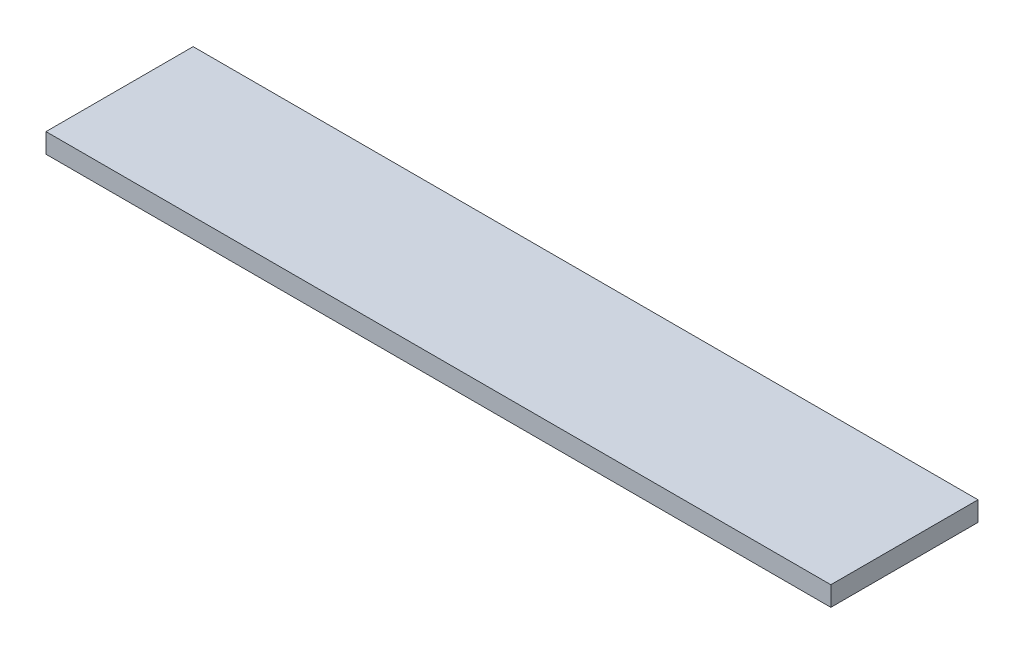
ISO-10303-21;
HEADER;
FILE_DESCRIPTION(('STEP AP214'),'2;1');
FILE_NAME('part.step','',(''),(''),'','','');
FILE_SCHEMA(('AUTOMOTIVE_DESIGN { 1 0 10303 214 1 1 1 1 }'));
ENDSEC;
DATA;
#1=APPLICATION_CONTEXT('core data for automotive mechanical design processes');
#2=APPLICATION_PROTOCOL_DEFINITION('international standard','automotive_design',2000,#1);
#3=PRODUCT_CONTEXT('',#1,'mechanical');
#4=PRODUCT('Part','Part','',(#3));
#5=PRODUCT_RELATED_PRODUCT_CATEGORY('part','',(#4));
#6=PRODUCT_DEFINITION_FORMATION('','',#4);
#7=PRODUCT_DEFINITION_CONTEXT('part definition',#1,'design');
#8=PRODUCT_DEFINITION('design','',#6,#7);
#9=PRODUCT_DEFINITION_SHAPE('','',#8);
#10=(LENGTH_UNIT() NAMED_UNIT(*) SI_UNIT(.MILLI.,.METRE.));
#11=(NAMED_UNIT(*) PLANE_ANGLE_UNIT() SI_UNIT($,.RADIAN.));
#12=(NAMED_UNIT(*) SI_UNIT($,.STERADIAN.) SOLID_ANGLE_UNIT());
#13=UNCERTAINTY_MEASURE_WITH_UNIT(LENGTH_MEASURE(1.E-05),#10,'distance_accuracy_value','');
#14=(GEOMETRIC_REPRESENTATION_CONTEXT(3) GLOBAL_UNCERTAINTY_ASSIGNED_CONTEXT((#13)) GLOBAL_UNIT_ASSIGNED_CONTEXT((#10,
#11,#12)) REPRESENTATION_CONTEXT('',''));
#15=CARTESIAN_POINT('',(0.,0.,0.));
#16=DIRECTION('',(0.,0.,1.));
#17=DIRECTION('',(1.,0.,0.));
#18=AXIS2_PLACEMENT_3D('',#15,#16,#17);
#19=CARTESIAN_POINT('',(400.,20.,-75.));
#20=DIRECTION('',(-1.,0.,0.));
#21=DIRECTION('',(0.,0.,1.));
#22=AXIS2_PLACEMENT_3D('',#19,#20,#21);
#23=PLANE('',#22);
#24=DIRECTION('',(0.,0.,-1.));
#25=VECTOR('',#24,1.);
#26=CARTESIAN_POINT('',(400.,0.,-75.));
#27=LINE('',#26,#25);
#28=CARTESIAN_POINT('',(400.,0.,75.));
#29=VERTEX_POINT('',#28);
#30=CARTESIAN_POINT('',(400.,0.,-75.));
#31=VERTEX_POINT('',#30);
#32=EDGE_CURVE('E100',#29,#31,#27,.T.);
#33=ORIENTED_EDGE('',*,*,#32,.T.);
#34=DIRECTION('',(0.,-1.,0.));
#35=VECTOR('',#34,1.);
#36=CARTESIAN_POINT('',(400.,20.,-75.));
#37=LINE('',#36,#35);
#38=CARTESIAN_POINT('',(400.,20.,-75.));
#39=VERTEX_POINT('',#38);
#40=EDGE_CURVE('E11',#39,#31,#37,.T.);
#41=ORIENTED_EDGE('',*,*,#40,.F.);
#42=DIRECTION('',(0.,0.,-1.));
#43=VECTOR('',#42,1.);
#44=CARTESIAN_POINT('',(400.,20.,-75.));
#45=LINE('',#44,#43);
#46=CARTESIAN_POINT('',(400.,20.,75.));
#47=VERTEX_POINT('',#46);
#48=EDGE_CURVE('E88',#47,#39,#45,.T.);
#49=ORIENTED_EDGE('',*,*,#48,.F.);
#50=DIRECTION('',(0.,-1.,0.));
#51=VECTOR('',#50,1.);
#52=CARTESIAN_POINT('',(400.,20.,75.));
#53=LINE('',#52,#51);
#54=EDGE_CURVE('E96',#47,#29,#53,.T.);
#55=ORIENTED_EDGE('',*,*,#54,.T.);
#56=EDGE_LOOP('',(#33,#41,#49,#55));
#57=FACE_BOUND('',#56,.T.);
#58=ADVANCED_FACE('F37',(#57),#23,.F.);
#59=CARTESIAN_POINT('',(-400.,20.,-75.));
#60=DIRECTION('',(0.,0.,1.));
#61=DIRECTION('',(1.,0.,0.));
#62=AXIS2_PLACEMENT_3D('',#59,#60,#61);
#63=PLANE('',#62);
#64=DIRECTION('',(-1.,0.,0.));
#65=VECTOR('',#64,1.);
#66=CARTESIAN_POINT('',(-400.,0.,-75.));
#67=LINE('',#66,#65);
#68=CARTESIAN_POINT('',(-400.,0.,-75.));
#69=VERTEX_POINT('',#68);
#70=EDGE_CURVE('E92',#31,#69,#67,.T.);
#71=ORIENTED_EDGE('',*,*,#70,.T.);
#72=DIRECTION('',(0.,-1.,0.));
#73=VECTOR('',#72,1.);
#74=CARTESIAN_POINT('',(-400.,20.,-75.));
#75=LINE('',#74,#73);
#76=CARTESIAN_POINT('',(-400.,20.,-75.));
#77=VERTEX_POINT('',#76);
#78=EDGE_CURVE('E45',#77,#69,#75,.T.);
#79=ORIENTED_EDGE('',*,*,#78,.F.);
#80=DIRECTION('',(-1.,0.,0.));
#81=VECTOR('',#80,1.);
#82=CARTESIAN_POINT('',(-400.,20.,-75.));
#83=LINE('',#82,#81);
#84=EDGE_CURVE('E83',#39,#77,#83,.T.);
#85=ORIENTED_EDGE('',*,*,#84,.F.);
#86=ORIENTED_EDGE('',*,*,#40,.T.);
#87=EDGE_LOOP('',(#71,#79,#85,#86));
#88=FACE_BOUND('',#87,.T.);
#89=ADVANCED_FACE('F91',(#88),#63,.F.);
#90=CARTESIAN_POINT('',(-400.,20.,-75.));
#91=DIRECTION('',(1.,0.,0.));
#92=DIRECTION('',(0.,0.,-1.));
#93=AXIS2_PLACEMENT_3D('',#90,#91,#92);
#94=PLANE('',#93);
#95=DIRECTION('',(0.,0.,1.));
#96=VECTOR('',#95,1.);
#97=CARTESIAN_POINT('',(-400.,0.,-75.));
#98=LINE('',#97,#96);
#99=CARTESIAN_POINT('',(-400.,0.,75.));
#100=VERTEX_POINT('',#99);
#101=EDGE_CURVE('E70',#69,#100,#98,.T.);
#102=ORIENTED_EDGE('',*,*,#101,.T.);
#103=DIRECTION('',(0.,-1.,0.));
#104=VECTOR('',#103,1.);
#105=CARTESIAN_POINT('',(-400.,20.,75.));
#106=LINE('',#105,#104);
#107=CARTESIAN_POINT('',(-400.,20.,75.));
#108=VERTEX_POINT('',#107);
#109=EDGE_CURVE('E93',#108,#100,#106,.T.);
#110=ORIENTED_EDGE('',*,*,#109,.F.);
#111=DIRECTION('',(0.,0.,1.));
#112=VECTOR('',#111,1.);
#113=CARTESIAN_POINT('',(-400.,20.,-75.));
#114=LINE('',#113,#112);
#115=EDGE_CURVE('E86',#77,#108,#114,.T.);
#116=ORIENTED_EDGE('',*,*,#115,.F.);
#117=ORIENTED_EDGE('',*,*,#78,.T.);
#118=EDGE_LOOP('',(#102,#110,#116,#117));
#119=FACE_BOUND('',#118,.T.);
#120=ADVANCED_FACE('F94',(#119),#94,.F.);
#121=CARTESIAN_POINT('',(-400.,20.,75.));
#122=DIRECTION('',(0.,0.,-1.));
#123=DIRECTION('',(-1.,0.,0.));
#124=AXIS2_PLACEMENT_3D('',#121,#122,#123);
#125=PLANE('',#124);
#126=DIRECTION('',(1.,0.,0.));
#127=VECTOR('',#126,1.);
#128=CARTESIAN_POINT('',(-400.,0.,75.));
#129=LINE('',#128,#127);
#130=EDGE_CURVE('E76',#100,#29,#129,.T.);
#131=ORIENTED_EDGE('',*,*,#130,.T.);
#132=ORIENTED_EDGE('',*,*,#54,.F.);
#133=DIRECTION('',(1.,0.,0.));
#134=VECTOR('',#133,1.);
#135=CARTESIAN_POINT('',(-400.,20.,75.));
#136=LINE('',#135,#134);
#137=EDGE_CURVE('E53',#108,#47,#136,.T.);
#138=ORIENTED_EDGE('',*,*,#137,.F.);
#139=ORIENTED_EDGE('',*,*,#109,.T.);
#140=EDGE_LOOP('',(#131,#132,#138,#139));
#141=FACE_BOUND('',#140,.T.);
#142=ADVANCED_FACE('F107',(#141),#125,.F.);
#143=CARTESIAN_POINT('',(0.,20.,0.));
#144=DIRECTION('',(0.,1.,0.));
#145=DIRECTION('',(0.,0.,1.));
#146=AXIS2_PLACEMENT_3D('',#143,#144,#145);
#147=PLANE('',#146);
#148=ORIENTED_EDGE('',*,*,#48,.T.);
#149=ORIENTED_EDGE('',*,*,#84,.T.);
#150=ORIENTED_EDGE('',*,*,#115,.T.);
#151=ORIENTED_EDGE('',*,*,#137,.T.);
#152=EDGE_LOOP('',(#148,#149,#150,#151));
#153=FACE_BOUND('',#152,.T.);
#154=ADVANCED_FACE('F84',(#153),#147,.T.);
#155=CARTESIAN_POINT('',(0.,0.,0.));
#156=DIRECTION('',(0.,1.,0.));
#157=DIRECTION('',(0.,0.,1.));
#158=AXIS2_PLACEMENT_3D('',#155,#156,#157);
#159=PLANE('',#158);
#160=ORIENTED_EDGE('',*,*,#32,.F.);
#161=ORIENTED_EDGE('',*,*,#130,.F.);
#162=ORIENTED_EDGE('',*,*,#101,.F.);
#163=ORIENTED_EDGE('',*,*,#70,.F.);
#164=EDGE_LOOP('',(#160,#161,#162,#163));
#165=FACE_BOUND('',#164,.T.);
#166=ADVANCED_FACE('F110',(#165),#159,.F.);
#167=CLOSED_SHELL('',(#58,#89,#120,#142,#154,#166));
#168=MANIFOLD_SOLID_BREP('B2',#167);
#169=ADVANCED_BREP_SHAPE_REPRESENTATION('',(#18,#168),#14);
#170=SHAPE_DEFINITION_REPRESENTATION(#9,#169);
ENDSEC;
END-ISO-10303-21;
